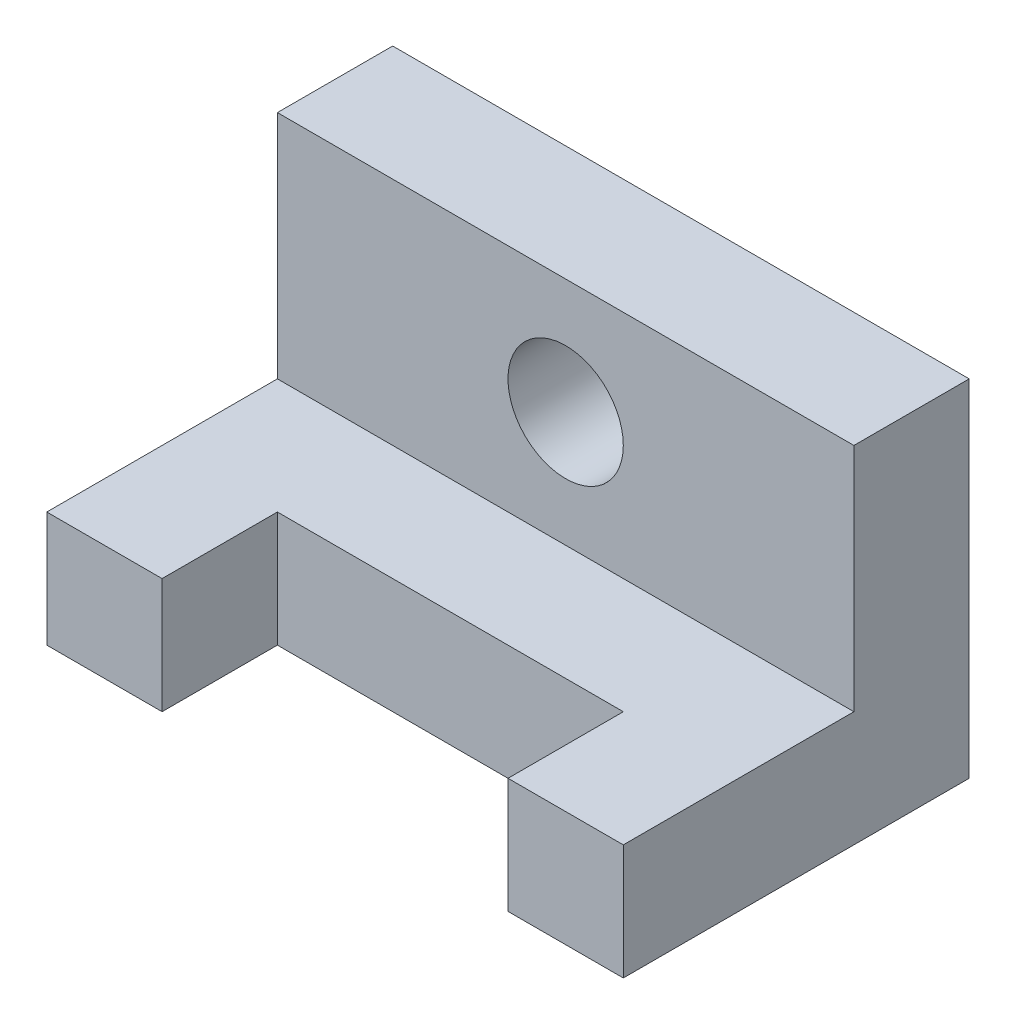
ISO-10303-21;
HEADER;
FILE_DESCRIPTION(('STEP AP214'),'2;1');
FILE_NAME('part.step','',(''),(''),'','','');
FILE_SCHEMA(('AUTOMOTIVE_DESIGN { 1 0 10303 214 1 1 1 1 }'));
ENDSEC;
DATA;
#1=APPLICATION_CONTEXT('core data for automotive mechanical design processes');
#2=APPLICATION_PROTOCOL_DEFINITION('international standard','automotive_design',2000,#1);
#3=PRODUCT_CONTEXT('',#1,'mechanical');
#4=PRODUCT('Part','Part','',(#3));
#5=PRODUCT_RELATED_PRODUCT_CATEGORY('part','',(#4));
#6=PRODUCT_DEFINITION_FORMATION('','',#4);
#7=PRODUCT_DEFINITION_CONTEXT('part definition',#1,'design');
#8=PRODUCT_DEFINITION('design','',#6,#7);
#9=PRODUCT_DEFINITION_SHAPE('','',#8);
#10=(LENGTH_UNIT() NAMED_UNIT(*) SI_UNIT(.MILLI.,.METRE.));
#11=(NAMED_UNIT(*) PLANE_ANGLE_UNIT() SI_UNIT($,.RADIAN.));
#12=(NAMED_UNIT(*) SI_UNIT($,.STERADIAN.) SOLID_ANGLE_UNIT());
#13=UNCERTAINTY_MEASURE_WITH_UNIT(LENGTH_MEASURE(1.E-05),#10,'distance_accuracy_value','');
#14=(GEOMETRIC_REPRESENTATION_CONTEXT(3) GLOBAL_UNCERTAINTY_ASSIGNED_CONTEXT((#13)) GLOBAL_UNIT_ASSIGNED_CONTEXT((#10,
#11,#12)) REPRESENTATION_CONTEXT('',''));
#15=CARTESIAN_POINT('',(0.,0.,0.));
#16=DIRECTION('',(0.,0.,1.));
#17=DIRECTION('',(1.,0.,0.));
#18=AXIS2_PLACEMENT_3D('',#15,#16,#17);
#19=CARTESIAN_POINT('',(50.,0.,60.));
#20=DIRECTION('',(0.,0.,-1.));
#21=DIRECTION('',(-1.,0.,0.));
#22=AXIS2_PLACEMENT_3D('',#19,#20,#21);
#23=PLANE('',#22);
#24=DIRECTION('',(-1.,0.,0.));
#25=VECTOR('',#24,1.);
#26=CARTESIAN_POINT('',(50.,0.,60.));
#27=LINE('',#26,#25);
#28=CARTESIAN_POINT('',(-30.,0.,60.));
#29=VERTEX_POINT('',#28);
#30=CARTESIAN_POINT('',(-50.,0.,60.));
#31=VERTEX_POINT('',#30);
#32=EDGE_CURVE('E133',#29,#31,#27,.T.);
#33=ORIENTED_EDGE('',*,*,#32,.F.);
#34=DIRECTION('',(0.,1.,0.));
#35=VECTOR('',#34,1.);
#36=CARTESIAN_POINT('',(-30.,-0.00100000000001141,60.));
#37=LINE('',#36,#35);
#38=CARTESIAN_POINT('',(-30.,20.,60.));
#39=VERTEX_POINT('',#38);
#40=EDGE_CURVE('E191',#29,#39,#37,.T.);
#41=ORIENTED_EDGE('',*,*,#40,.T.);
#42=DIRECTION('',(-1.,0.,0.));
#43=VECTOR('',#42,1.);
#44=CARTESIAN_POINT('',(50.,20.,60.));
#45=LINE('',#44,#43);
#46=CARTESIAN_POINT('',(-50.,20.,60.));
#47=VERTEX_POINT('',#46);
#48=EDGE_CURVE('E132',#39,#47,#45,.T.);
#49=ORIENTED_EDGE('',*,*,#48,.T.);
#50=DIRECTION('',(0.,-1.,0.));
#51=VECTOR('',#50,1.);
#52=CARTESIAN_POINT('',(-50.,0.,60.));
#53=LINE('',#52,#51);
#54=EDGE_CURVE('E157',#47,#31,#53,.T.);
#55=ORIENTED_EDGE('',*,*,#54,.T.);
#56=EDGE_LOOP('',(#33,#41,#49,#55));
#57=FACE_BOUND('',#56,.T.);
#58=ADVANCED_FACE('F40',(#57),#23,.F.);
#59=CARTESIAN_POINT('',(50.,60.,0.));
#60=DIRECTION('',(0.,-1.,0.));
#61=DIRECTION('',(0.,0.,-1.));
#62=AXIS2_PLACEMENT_3D('',#59,#60,#61);
#63=PLANE('',#62);
#64=DIRECTION('',(0.,0.,1.));
#65=VECTOR('',#64,1.);
#66=CARTESIAN_POINT('',(-50.,60.,0.));
#67=LINE('',#66,#65);
#68=CARTESIAN_POINT('',(-50.,60.,0.));
#69=VERTEX_POINT('',#68);
#70=CARTESIAN_POINT('',(-50.,60.,20.));
#71=VERTEX_POINT('',#70);
#72=EDGE_CURVE('E145',#69,#71,#67,.T.);
#73=ORIENTED_EDGE('',*,*,#72,.T.);
#74=DIRECTION('',(-1.,0.,0.));
#75=VECTOR('',#74,1.);
#76=CARTESIAN_POINT('',(50.,60.,20.));
#77=LINE('',#76,#75);
#78=CARTESIAN_POINT('',(50.,60.,20.));
#79=VERTEX_POINT('',#78);
#80=EDGE_CURVE('E11',#79,#71,#77,.T.);
#81=ORIENTED_EDGE('',*,*,#80,.F.);
#82=DIRECTION('',(0.,0.,1.));
#83=VECTOR('',#82,1.);
#84=CARTESIAN_POINT('',(50.,60.,0.));
#85=LINE('',#84,#83);
#86=CARTESIAN_POINT('',(50.,60.,0.));
#87=VERTEX_POINT('',#86);
#88=EDGE_CURVE('E166',#87,#79,#85,.T.);
#89=ORIENTED_EDGE('',*,*,#88,.F.);
#90=DIRECTION('',(-1.,0.,0.));
#91=VECTOR('',#90,1.);
#92=CARTESIAN_POINT('',(50.,60.,0.));
#93=LINE('',#92,#91);
#94=EDGE_CURVE('E141',#87,#69,#93,.T.);
#95=ORIENTED_EDGE('',*,*,#94,.T.);
#96=EDGE_LOOP('',(#73,#81,#89,#95));
#97=FACE_BOUND('',#96,.T.);
#98=ADVANCED_FACE('F42',(#97),#63,.F.);
#99=CARTESIAN_POINT('',(50.,60.,20.));
#100=DIRECTION('',(0.,0.,-1.));
#101=DIRECTION('',(0.,1.,0.));
#102=AXIS2_PLACEMENT_3D('',#99,#100,#101);
#103=PLANE('',#102);
#104=CARTESIAN_POINT('',(0.,40.,20.));
#105=DIRECTION('',(0.,0.,1.));
#106=DIRECTION('',(1.,0.,0.));
#107=AXIS2_PLACEMENT_3D('',#104,#105,#106);
#108=CIRCLE('',#107,10.);
#109=CARTESIAN_POINT('',(10.,40.,20.));
#110=VERTEX_POINT('',#109);
#111=EDGE_CURVE('E307',#110,#110,#108,.T.);
#112=ORIENTED_EDGE('',*,*,#111,.F.);
#113=EDGE_LOOP('',(#112));
#114=FACE_BOUND('',#113,.T.);
#115=DIRECTION('',(0.,-1.,0.));
#116=VECTOR('',#115,1.);
#117=CARTESIAN_POINT('',(-50.,60.,20.));
#118=LINE('',#117,#116);
#119=CARTESIAN_POINT('',(-50.,20.,20.));
#120=VERTEX_POINT('',#119);
#121=EDGE_CURVE('E149',#71,#120,#118,.T.);
#122=ORIENTED_EDGE('',*,*,#121,.T.);
#123=DIRECTION('',(-1.,0.,0.));
#124=VECTOR('',#123,1.);
#125=CARTESIAN_POINT('',(50.,20.,20.));
#126=LINE('',#125,#124);
#127=CARTESIAN_POINT('',(50.,20.,20.));
#128=VERTEX_POINT('',#127);
#129=EDGE_CURVE('E49',#128,#120,#126,.T.);
#130=ORIENTED_EDGE('',*,*,#129,.F.);
#131=DIRECTION('',(0.,-1.,0.));
#132=VECTOR('',#131,1.);
#133=CARTESIAN_POINT('',(50.,60.,20.));
#134=LINE('',#133,#132);
#135=EDGE_CURVE('E100',#79,#128,#134,.T.);
#136=ORIENTED_EDGE('',*,*,#135,.F.);
#137=ORIENTED_EDGE('',*,*,#80,.T.);
#138=EDGE_LOOP('',(#122,#130,#136,#137));
#139=FACE_BOUND('',#138,.T.);
#140=ADVANCED_FACE('F261',(#114,#139),#103,.F.);
#141=CARTESIAN_POINT('',(50.,20.,20.));
#142=DIRECTION('',(0.,-1.,0.));
#143=DIRECTION('',(0.,0.,-1.));
#144=AXIS2_PLACEMENT_3D('',#141,#142,#143);
#145=PLANE('',#144);
#146=ORIENTED_EDGE('',*,*,#48,.F.);
#147=DIRECTION('',(0.,0.,1.));
#148=VECTOR('',#147,1.);
#149=CARTESIAN_POINT('',(-30.,20.,60.));
#150=LINE('',#149,#148);
#151=CARTESIAN_POINT('',(-30.,20.,40.));
#152=VERTEX_POINT('',#151);
#153=EDGE_CURVE('E209',#152,#39,#150,.T.);
#154=ORIENTED_EDGE('',*,*,#153,.F.);
#155=DIRECTION('',(-1.,0.,0.));
#156=VECTOR('',#155,1.);
#157=CARTESIAN_POINT('',(-30.,20.,40.));
#158=LINE('',#157,#156);
#159=CARTESIAN_POINT('',(30.,20.,40.));
#160=VERTEX_POINT('',#159);
#161=EDGE_CURVE('E224',#160,#152,#158,.T.);
#162=ORIENTED_EDGE('',*,*,#161,.F.);
#163=DIRECTION('',(0.,0.,-1.));
#164=VECTOR('',#163,1.);
#165=CARTESIAN_POINT('',(30.,20.,60.));
#166=LINE('',#165,#164);
#167=CARTESIAN_POINT('',(30.,20.,60.));
#168=VERTEX_POINT('',#167);
#169=EDGE_CURVE('E215',#168,#160,#166,.T.);
#170=ORIENTED_EDGE('',*,*,#169,.F.);
#171=CARTESIAN_POINT('',(50.,20.,60.));
#172=VERTEX_POINT('',#171);
#173=EDGE_CURVE('E171',#172,#168,#45,.T.);
#174=ORIENTED_EDGE('',*,*,#173,.F.);
#175=DIRECTION('',(0.,0.,1.));
#176=VECTOR('',#175,1.);
#177=CARTESIAN_POINT('',(50.,20.,20.));
#178=LINE('',#177,#176);
#179=EDGE_CURVE('E116',#128,#172,#178,.T.);
#180=ORIENTED_EDGE('',*,*,#179,.F.);
#181=ORIENTED_EDGE('',*,*,#129,.T.);
#182=DIRECTION('',(0.,0.,1.));
#183=VECTOR('',#182,1.);
#184=CARTESIAN_POINT('',(-50.,20.,20.));
#185=LINE('',#184,#183);
#186=EDGE_CURVE('E153',#120,#47,#185,.T.);
#187=ORIENTED_EDGE('',*,*,#186,.T.);
#188=EDGE_LOOP('',(#146,#154,#162,#170,#174,#180,#181,#187));
#189=FACE_BOUND('',#188,.T.);
#190=ADVANCED_FACE('F179',(#189),#145,.F.);
#191=ORIENTED_EDGE('',*,*,#173,.T.);
#192=DIRECTION('',(0.,1.,0.));
#193=VECTOR('',#192,1.);
#194=CARTESIAN_POINT('',(30.,-0.00100000000001141,60.));
#195=LINE('',#194,#193);
#196=CARTESIAN_POINT('',(30.,0.,60.));
#197=VERTEX_POINT('',#196);
#198=EDGE_CURVE('E128',#197,#168,#195,.T.);
#199=ORIENTED_EDGE('',*,*,#198,.F.);
#200=CARTESIAN_POINT('',(50.,0.,60.));
#201=VERTEX_POINT('',#200);
#202=EDGE_CURVE('E124',#201,#197,#27,.T.);
#203=ORIENTED_EDGE('',*,*,#202,.F.);
#204=DIRECTION('',(0.,-1.,0.));
#205=VECTOR('',#204,1.);
#206=CARTESIAN_POINT('',(50.,0.,60.));
#207=LINE('',#206,#205);
#208=EDGE_CURVE('E109',#172,#201,#207,.T.);
#209=ORIENTED_EDGE('',*,*,#208,.F.);
#210=EDGE_LOOP('',(#191,#199,#203,#209));
#211=FACE_BOUND('',#210,.T.);
#212=ADVANCED_FACE('F125',(#211),#23,.F.);
#213=CARTESIAN_POINT('',(50.,0.,0.));
#214=DIRECTION('',(0.,1.,0.));
#215=DIRECTION('',(0.,0.,1.));
#216=AXIS2_PLACEMENT_3D('',#213,#214,#215);
#217=PLANE('',#216);
#218=DIRECTION('',(1.,0.,0.));
#219=VECTOR('',#218,1.);
#220=CARTESIAN_POINT('',(-30.,0.,40.));
#221=LINE('',#220,#219);
#222=CARTESIAN_POINT('',(-30.,0.,40.));
#223=VERTEX_POINT('',#222);
#224=CARTESIAN_POINT('',(30.,0.,40.));
#225=VERTEX_POINT('',#224);
#226=EDGE_CURVE('E56',#223,#225,#221,.T.);
#227=ORIENTED_EDGE('',*,*,#226,.F.);
#228=DIRECTION('',(0.,0.,-1.));
#229=VECTOR('',#228,1.);
#230=CARTESIAN_POINT('',(-30.,0.,60.));
#231=LINE('',#230,#229);
#232=EDGE_CURVE('E204',#29,#223,#231,.T.);
#233=ORIENTED_EDGE('',*,*,#232,.F.);
#234=ORIENTED_EDGE('',*,*,#32,.T.);
#235=DIRECTION('',(0.,0.,-1.));
#236=VECTOR('',#235,1.);
#237=CARTESIAN_POINT('',(-50.,0.,0.));
#238=LINE('',#237,#236);
#239=CARTESIAN_POINT('',(-50.,0.,0.));
#240=VERTEX_POINT('',#239);
#241=EDGE_CURVE('E161',#31,#240,#238,.T.);
#242=ORIENTED_EDGE('',*,*,#241,.T.);
#243=DIRECTION('',(-1.,0.,0.));
#244=VECTOR('',#243,1.);
#245=CARTESIAN_POINT('',(50.,0.,0.));
#246=LINE('',#245,#244);
#247=CARTESIAN_POINT('',(50.,0.,0.));
#248=VERTEX_POINT('',#247);
#249=EDGE_CURVE('E136',#248,#240,#246,.T.);
#250=ORIENTED_EDGE('',*,*,#249,.F.);
#251=DIRECTION('',(0.,0.,-1.));
#252=VECTOR('',#251,1.);
#253=CARTESIAN_POINT('',(50.,0.,0.));
#254=LINE('',#253,#252);
#255=EDGE_CURVE('E113',#201,#248,#254,.T.);
#256=ORIENTED_EDGE('',*,*,#255,.F.);
#257=ORIENTED_EDGE('',*,*,#202,.T.);
#258=DIRECTION('',(0.,0.,1.));
#259=VECTOR('',#258,1.);
#260=CARTESIAN_POINT('',(30.,0.,60.));
#261=LINE('',#260,#259);
#262=EDGE_CURVE('E217',#225,#197,#261,.T.);
#263=ORIENTED_EDGE('',*,*,#262,.F.);
#264=EDGE_LOOP('',(#227,#233,#234,#242,#250,#256,#257,#263));
#265=FACE_BOUND('',#264,.T.);
#266=ADVANCED_FACE('F135',(#265),#217,.F.);
#267=CARTESIAN_POINT('',(50.,60.,0.));
#268=DIRECTION('',(0.,0.,1.));
#269=DIRECTION('',(1.,0.,0.));
#270=AXIS2_PLACEMENT_3D('',#267,#268,#269);
#271=PLANE('',#270);
#272=CARTESIAN_POINT('',(0.,40.,0.));
#273=DIRECTION('',(0.,0.,1.));
#274=DIRECTION('',(1.,0.,0.));
#275=AXIS2_PLACEMENT_3D('',#272,#273,#274);
#276=CIRCLE('',#275,10.);
#277=CARTESIAN_POINT('',(10.,40.,0.));
#278=VERTEX_POINT('',#277);
#279=EDGE_CURVE('E310',#278,#278,#276,.F.);
#280=ORIENTED_EDGE('',*,*,#279,.F.);
#281=EDGE_LOOP('',(#280));
#282=FACE_BOUND('',#281,.T.);
#283=DIRECTION('',(0.,1.,0.));
#284=VECTOR('',#283,1.);
#285=CARTESIAN_POINT('',(-50.,60.,0.));
#286=LINE('',#285,#284);
#287=EDGE_CURVE('E92',#240,#69,#286,.T.);
#288=ORIENTED_EDGE('',*,*,#287,.T.);
#289=ORIENTED_EDGE('',*,*,#94,.F.);
#290=DIRECTION('',(0.,1.,0.));
#291=VECTOR('',#290,1.);
#292=CARTESIAN_POINT('',(50.,60.,0.));
#293=LINE('',#292,#291);
#294=EDGE_CURVE('E65',#248,#87,#293,.T.);
#295=ORIENTED_EDGE('',*,*,#294,.F.);
#296=ORIENTED_EDGE('',*,*,#249,.T.);
#297=EDGE_LOOP('',(#288,#289,#295,#296));
#298=FACE_BOUND('',#297,.T.);
#299=ADVANCED_FACE('F279',(#282,#298),#271,.F.);
#300=CARTESIAN_POINT('',(50.,0.,0.));
#301=DIRECTION('',(1.,0.,0.));
#302=DIRECTION('',(0.,0.,-1.));
#303=AXIS2_PLACEMENT_3D('',#300,#301,#302);
#304=PLANE('',#303);
#305=ORIENTED_EDGE('',*,*,#88,.T.);
#306=ORIENTED_EDGE('',*,*,#135,.T.);
#307=ORIENTED_EDGE('',*,*,#179,.T.);
#308=ORIENTED_EDGE('',*,*,#208,.T.);
#309=ORIENTED_EDGE('',*,*,#255,.T.);
#310=ORIENTED_EDGE('',*,*,#294,.T.);
#311=EDGE_LOOP('',(#305,#306,#307,#308,#309,#310));
#312=FACE_BOUND('',#311,.T.);
#313=ADVANCED_FACE('F111',(#312),#304,.T.);
#314=CARTESIAN_POINT('',(-50.,0.,0.));
#315=DIRECTION('',(1.,0.,0.));
#316=DIRECTION('',(0.,0.,-1.));
#317=AXIS2_PLACEMENT_3D('',#314,#315,#316);
#318=PLANE('',#317);
#319=ORIENTED_EDGE('',*,*,#72,.F.);
#320=ORIENTED_EDGE('',*,*,#287,.F.);
#321=ORIENTED_EDGE('',*,*,#241,.F.);
#322=ORIENTED_EDGE('',*,*,#54,.F.);
#323=ORIENTED_EDGE('',*,*,#186,.F.);
#324=ORIENTED_EDGE('',*,*,#121,.F.);
#325=EDGE_LOOP('',(#319,#320,#321,#322,#323,#324));
#326=FACE_BOUND('',#325,.T.);
#327=ADVANCED_FACE('F183',(#326),#318,.F.);
#328=CARTESIAN_POINT('',(-30.,-0.00100000000001141,60.));
#329=DIRECTION('',(-1.,0.,0.));
#330=DIRECTION('',(0.,0.,1.));
#331=AXIS2_PLACEMENT_3D('',#328,#329,#330);
#332=PLANE('',#331);
#333=ORIENTED_EDGE('',*,*,#232,.T.);
#334=DIRECTION('',(0.,1.,0.));
#335=VECTOR('',#334,1.);
#336=CARTESIAN_POINT('',(-30.,-0.00100000000000794,40.));
#337=LINE('',#336,#335);
#338=EDGE_CURVE('E150',#223,#152,#337,.T.);
#339=ORIENTED_EDGE('',*,*,#338,.T.);
#340=ORIENTED_EDGE('',*,*,#153,.T.);
#341=ORIENTED_EDGE('',*,*,#40,.F.);
#342=EDGE_LOOP('',(#333,#339,#340,#341));
#343=FACE_BOUND('',#342,.T.);
#344=ADVANCED_FACE('F288',(#343),#332,.F.);
#345=CARTESIAN_POINT('',(-30.,-0.00100000000000794,40.));
#346=DIRECTION('',(0.,0.,-1.));
#347=DIRECTION('',(0.,1.,0.));
#348=AXIS2_PLACEMENT_3D('',#345,#346,#347);
#349=PLANE('',#348);
#350=ORIENTED_EDGE('',*,*,#226,.T.);
#351=DIRECTION('',(0.,1.,0.));
#352=VECTOR('',#351,1.);
#353=CARTESIAN_POINT('',(30.,-0.00100000000000794,40.));
#354=LINE('',#353,#352);
#355=EDGE_CURVE('E230',#225,#160,#354,.T.);
#356=ORIENTED_EDGE('',*,*,#355,.T.);
#357=ORIENTED_EDGE('',*,*,#161,.T.);
#358=ORIENTED_EDGE('',*,*,#338,.F.);
#359=EDGE_LOOP('',(#350,#356,#357,#358));
#360=FACE_BOUND('',#359,.T.);
#361=ADVANCED_FACE('F293',(#360),#349,.F.);
#362=CARTESIAN_POINT('',(30.,-0.00100000000001141,60.));
#363=DIRECTION('',(1.,0.,0.));
#364=DIRECTION('',(0.,0.,-1.));
#365=AXIS2_PLACEMENT_3D('',#362,#363,#364);
#366=PLANE('',#365);
#367=ORIENTED_EDGE('',*,*,#262,.T.);
#368=ORIENTED_EDGE('',*,*,#198,.T.);
#369=ORIENTED_EDGE('',*,*,#169,.T.);
#370=ORIENTED_EDGE('',*,*,#355,.F.);
#371=EDGE_LOOP('',(#367,#368,#369,#370));
#372=FACE_BOUND('',#371,.T.);
#373=ADVANCED_FACE('F294',(#372),#366,.F.);
#374=CARTESIAN_POINT('',(0.,40.,-0.001000000000001));
#375=DIRECTION('',(0.,0.,1.));
#376=DIRECTION('',(1.,0.,0.));
#377=AXIS2_PLACEMENT_3D('',#374,#375,#376);
#378=CYLINDRICAL_SURFACE('',#377,10.);
#379=ORIENTED_EDGE('',*,*,#111,.T.);
#380=EDGE_LOOP('',(#379));
#381=FACE_BOUND('',#380,.T.);
#382=ORIENTED_EDGE('',*,*,#279,.T.);
#383=EDGE_LOOP('',(#382));
#384=FACE_BOUND('',#383,.T.);
#385=ADVANCED_FACE('F297',(#381,#384),#378,.F.);
#386=CLOSED_SHELL('',(#58,#98,#140,#190,#212,#266,#299,#313,#327,#344,#361,#373,#385));
#387=MANIFOLD_SOLID_BREP('B2',#386);
#388=ADVANCED_BREP_SHAPE_REPRESENTATION('',(#18,#387),#14);
#389=SHAPE_DEFINITION_REPRESENTATION(#9,#388);
ENDSEC;
END-ISO-10303-21;
